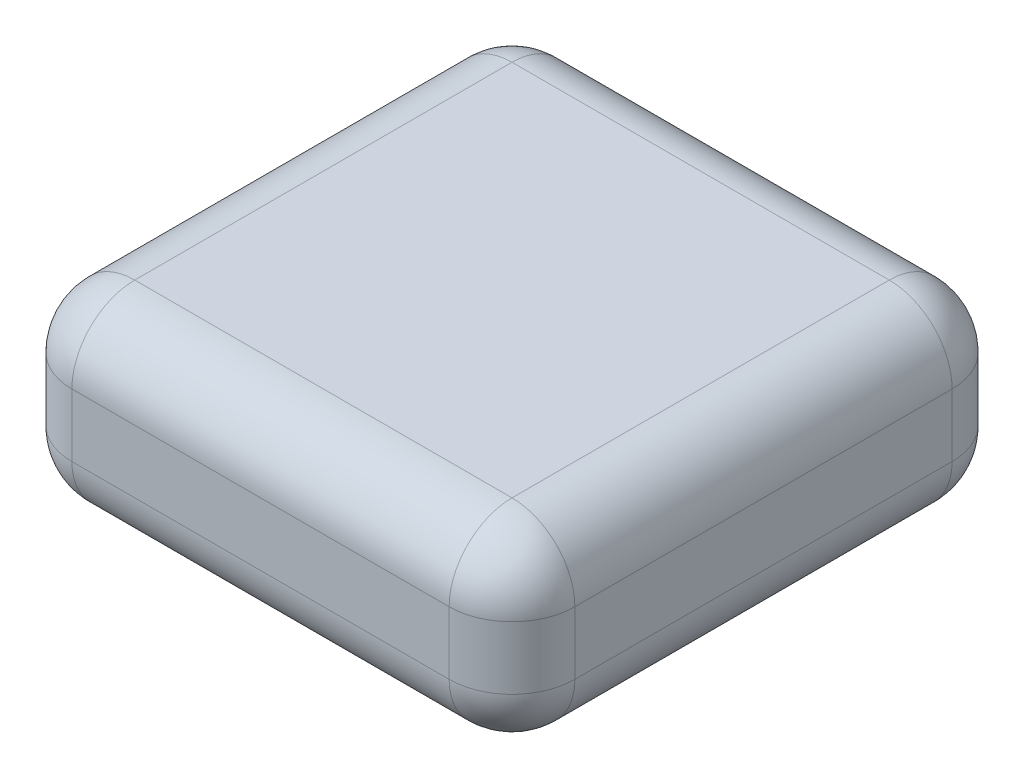
ISO-10303-21;
HEADER;
FILE_DESCRIPTION(('STEP AP214'),'2;1');
FILE_NAME('part.step','',(''),(''),'','','');
FILE_SCHEMA(('AUTOMOTIVE_DESIGN { 1 0 10303 214 1 1 1 1 }'));
ENDSEC;
DATA;
#1=APPLICATION_CONTEXT('core data for automotive mechanical design processes');
#2=APPLICATION_PROTOCOL_DEFINITION('international standard','automotive_design',2000,#1);
#3=PRODUCT_CONTEXT('',#1,'mechanical');
#4=PRODUCT('Part','Part','',(#3));
#5=PRODUCT_RELATED_PRODUCT_CATEGORY('part','',(#4));
#6=PRODUCT_DEFINITION_FORMATION('','',#4);
#7=PRODUCT_DEFINITION_CONTEXT('part definition',#1,'design');
#8=PRODUCT_DEFINITION('design','',#6,#7);
#9=PRODUCT_DEFINITION_SHAPE('','',#8);
#10=(LENGTH_UNIT() NAMED_UNIT(*) SI_UNIT(.MILLI.,.METRE.));
#11=(NAMED_UNIT(*) PLANE_ANGLE_UNIT() SI_UNIT($,.RADIAN.));
#12=(NAMED_UNIT(*) SI_UNIT($,.STERADIAN.) SOLID_ANGLE_UNIT());
#13=UNCERTAINTY_MEASURE_WITH_UNIT(LENGTH_MEASURE(1.E-05),#10,'distance_accuracy_value','');
#14=(GEOMETRIC_REPRESENTATION_CONTEXT(3) GLOBAL_UNCERTAINTY_ASSIGNED_CONTEXT((#13)) GLOBAL_UNIT_ASSIGNED_CONTEXT((#10,
#11,#12)) REPRESENTATION_CONTEXT('',''));
#15=CARTESIAN_POINT('',(0.,0.,0.));
#16=DIRECTION('',(0.,0.,1.));
#17=DIRECTION('',(1.,0.,0.));
#18=AXIS2_PLACEMENT_3D('',#15,#16,#17);
#19=CARTESIAN_POINT('',(609.6,457.2,-609.6));
#20=DIRECTION('',(-1.,0.,0.));
#21=DIRECTION('',(0.,0.,1.));
#22=AXIS2_PLACEMENT_3D('',#19,#20,#21);
#23=PLANE('',#22);
#24=DIRECTION('',(0.,0.,-1.));
#25=VECTOR('',#24,1.);
#26=CARTESIAN_POINT('',(609.6,152.4,-609.6));
#27=LINE('',#26,#25);
#28=CARTESIAN_POINT('',(609.6,152.4,457.2));
#29=VERTEX_POINT('',#28);
#30=CARTESIAN_POINT('',(609.6,152.4,-457.2));
#31=VERTEX_POINT('',#30);
#32=EDGE_CURVE('E172',#29,#31,#27,.T.);
#33=ORIENTED_EDGE('',*,*,#32,.T.);
#34=DIRECTION('',(0.,-1.,0.));
#35=VECTOR('',#34,1.);
#36=CARTESIAN_POINT('',(609.6,457.2,-457.2));
#37=LINE('',#36,#35);
#38=CARTESIAN_POINT('',(609.6,304.8,-457.2));
#39=VERTEX_POINT('',#38);
#40=EDGE_CURVE('E175',#31,#39,#37,.F.);
#41=ORIENTED_EDGE('',*,*,#40,.T.);
#42=DIRECTION('',(0.,0.,-1.));
#43=VECTOR('',#42,1.);
#44=CARTESIAN_POINT('',(609.6,304.8,609.6));
#45=LINE('',#44,#43);
#46=CARTESIAN_POINT('',(609.6,304.8,457.2));
#47=VERTEX_POINT('',#46);
#48=EDGE_CURVE('E170',#39,#47,#45,.F.);
#49=ORIENTED_EDGE('',*,*,#48,.T.);
#50=DIRECTION('',(0.,-1.,0.));
#51=VECTOR('',#50,1.);
#52=CARTESIAN_POINT('',(609.6,457.2,457.2));
#53=LINE('',#52,#51);
#54=EDGE_CURVE('E168',#47,#29,#53,.T.);
#55=ORIENTED_EDGE('',*,*,#54,.T.);
#56=EDGE_LOOP('',(#33,#41,#49,#55));
#57=FACE_BOUND('',#56,.T.);
#58=ADVANCED_FACE('F33',(#57),#23,.F.);
#59=CARTESIAN_POINT('',(-609.6,457.2,-609.6));
#60=DIRECTION('',(0.,0.,1.));
#61=DIRECTION('',(1.,0.,0.));
#62=AXIS2_PLACEMENT_3D('',#59,#60,#61);
#63=PLANE('',#62);
#64=DIRECTION('',(-1.,0.,0.));
#65=VECTOR('',#64,1.);
#66=CARTESIAN_POINT('',(609.6,304.8,-609.6));
#67=LINE('',#66,#65);
#68=CARTESIAN_POINT('',(-457.2,304.8,-609.6));
#69=VERTEX_POINT('',#68);
#70=CARTESIAN_POINT('',(457.2,304.8,-609.6));
#71=VERTEX_POINT('',#70);
#72=EDGE_CURVE('E190',#69,#71,#67,.F.);
#73=ORIENTED_EDGE('',*,*,#72,.T.);
#74=DIRECTION('',(0.,-1.,0.));
#75=VECTOR('',#74,1.);
#76=CARTESIAN_POINT('',(457.2,457.2,-609.6));
#77=LINE('',#76,#75);
#78=CARTESIAN_POINT('',(457.2,152.4,-609.6));
#79=VERTEX_POINT('',#78);
#80=EDGE_CURVE('E192',#71,#79,#77,.T.);
#81=ORIENTED_EDGE('',*,*,#80,.T.);
#82=DIRECTION('',(-1.,0.,0.));
#83=VECTOR('',#82,1.);
#84=CARTESIAN_POINT('',(-609.6,152.4,-609.6));
#85=LINE('',#84,#83);
#86=CARTESIAN_POINT('',(-457.2,152.4,-609.6));
#87=VERTEX_POINT('',#86);
#88=EDGE_CURVE('E186',#79,#87,#85,.T.);
#89=ORIENTED_EDGE('',*,*,#88,.T.);
#90=DIRECTION('',(0.,-1.,0.));
#91=VECTOR('',#90,1.);
#92=CARTESIAN_POINT('',(-457.2,457.2,-609.6));
#93=LINE('',#92,#91);
#94=EDGE_CURVE('E188',#87,#69,#93,.F.);
#95=ORIENTED_EDGE('',*,*,#94,.T.);
#96=EDGE_LOOP('',(#73,#81,#89,#95));
#97=FACE_BOUND('',#96,.T.);
#98=ADVANCED_FACE('F270',(#97),#63,.F.);
#99=CARTESIAN_POINT('',(-609.6,457.2,-609.6));
#100=DIRECTION('',(1.,0.,0.));
#101=DIRECTION('',(0.,0.,-1.));
#102=AXIS2_PLACEMENT_3D('',#99,#100,#101);
#103=PLANE('',#102);
#104=DIRECTION('',(0.,0.,1.));
#105=VECTOR('',#104,1.);
#106=CARTESIAN_POINT('',(-609.6,304.8,-609.6));
#107=LINE('',#106,#105);
#108=CARTESIAN_POINT('',(-609.6,304.8,457.2));
#109=VERTEX_POINT('',#108);
#110=CARTESIAN_POINT('',(-609.6,304.8,-457.2));
#111=VERTEX_POINT('',#110);
#112=EDGE_CURVE('E151',#109,#111,#107,.F.);
#113=ORIENTED_EDGE('',*,*,#112,.T.);
#114=DIRECTION('',(0.,-1.,0.));
#115=VECTOR('',#114,1.);
#116=CARTESIAN_POINT('',(-609.6,457.2,-457.2));
#117=LINE('',#116,#115);
#118=CARTESIAN_POINT('',(-609.6,152.4,-457.2));
#119=VERTEX_POINT('',#118);
#120=EDGE_CURVE('E155',#111,#119,#117,.T.);
#121=ORIENTED_EDGE('',*,*,#120,.T.);
#122=DIRECTION('',(0.,0.,1.));
#123=VECTOR('',#122,1.);
#124=CARTESIAN_POINT('',(-609.6,152.4,-609.6));
#125=LINE('',#124,#123);
#126=CARTESIAN_POINT('',(-609.6,152.4,457.2));
#127=VERTEX_POINT('',#126);
#128=EDGE_CURVE('E127',#119,#127,#125,.T.);
#129=ORIENTED_EDGE('',*,*,#128,.T.);
#130=DIRECTION('',(0.,-1.,0.));
#131=VECTOR('',#130,1.);
#132=CARTESIAN_POINT('',(-609.6,457.2,457.2));
#133=LINE('',#132,#131);
#134=EDGE_CURVE('E145',#127,#109,#133,.F.);
#135=ORIENTED_EDGE('',*,*,#134,.T.);
#136=EDGE_LOOP('',(#113,#121,#129,#135));
#137=FACE_BOUND('',#136,.T.);
#138=ADVANCED_FACE('F153',(#137),#103,.F.);
#139=CARTESIAN_POINT('',(-609.6,457.2,609.6));
#140=DIRECTION('',(0.,0.,-1.));
#141=DIRECTION('',(-1.,0.,0.));
#142=AXIS2_PLACEMENT_3D('',#139,#140,#141);
#143=PLANE('',#142);
#144=DIRECTION('',(1.,0.,0.));
#145=VECTOR('',#144,1.);
#146=CARTESIAN_POINT('',(-609.6,304.8,609.6));
#147=LINE('',#146,#145);
#148=CARTESIAN_POINT('',(457.2,304.8,609.6));
#149=VERTEX_POINT('',#148);
#150=CARTESIAN_POINT('',(-457.2,304.8,609.6));
#151=VERTEX_POINT('',#150);
#152=EDGE_CURVE('E42',#149,#151,#147,.F.);
#153=ORIENTED_EDGE('',*,*,#152,.T.);
#154=DIRECTION('',(0.,-1.,0.));
#155=VECTOR('',#154,1.);
#156=CARTESIAN_POINT('',(-457.2,457.2,609.6));
#157=LINE('',#156,#155);
#158=CARTESIAN_POINT('',(-457.2,152.4,609.6));
#159=VERTEX_POINT('',#158);
#160=EDGE_CURVE('E11',#151,#159,#157,.T.);
#161=ORIENTED_EDGE('',*,*,#160,.T.);
#162=DIRECTION('',(1.,0.,0.));
#163=VECTOR('',#162,1.);
#164=CARTESIAN_POINT('',(-609.6,152.4,609.6));
#165=LINE('',#164,#163);
#166=CARTESIAN_POINT('',(457.2,152.4,609.6));
#167=VERTEX_POINT('',#166);
#168=EDGE_CURVE('E195',#159,#167,#165,.T.);
#169=ORIENTED_EDGE('',*,*,#168,.T.);
#170=DIRECTION('',(0.,-1.,0.));
#171=VECTOR('',#170,1.);
#172=CARTESIAN_POINT('',(457.2,457.2,609.6));
#173=LINE('',#172,#171);
#174=EDGE_CURVE('E53',#167,#149,#173,.F.);
#175=ORIENTED_EDGE('',*,*,#174,.T.);
#176=EDGE_LOOP('',(#153,#161,#169,#175));
#177=FACE_BOUND('',#176,.T.);
#178=ADVANCED_FACE('F362',(#177),#143,.F.);
#179=CARTESIAN_POINT('',(0.,457.2,0.));
#180=DIRECTION('',(0.,1.,0.));
#181=DIRECTION('',(0.,0.,1.));
#182=AXIS2_PLACEMENT_3D('',#179,#180,#181);
#183=PLANE('',#182);
#184=DIRECTION('',(0.,0.,-1.));
#185=VECTOR('',#184,1.);
#186=CARTESIAN_POINT('',(457.2,457.2,-609.6));
#187=LINE('',#186,#185);
#188=CARTESIAN_POINT('',(457.2,457.2,457.2));
#189=VERTEX_POINT('',#188);
#190=CARTESIAN_POINT('',(457.2,457.2,-457.2));
#191=VERTEX_POINT('',#190);
#192=EDGE_CURVE('E179',#189,#191,#187,.T.);
#193=ORIENTED_EDGE('',*,*,#192,.T.);
#194=DIRECTION('',(-1.,0.,0.));
#195=VECTOR('',#194,1.);
#196=CARTESIAN_POINT('',(-609.6,457.2,-457.2));
#197=LINE('',#196,#195);
#198=CARTESIAN_POINT('',(-457.2,457.2,-457.2));
#199=VERTEX_POINT('',#198);
#200=EDGE_CURVE('E184',#191,#199,#197,.T.);
#201=ORIENTED_EDGE('',*,*,#200,.T.);
#202=DIRECTION('',(0.,0.,1.));
#203=VECTOR('',#202,1.);
#204=CARTESIAN_POINT('',(-457.2,457.2,609.6));
#205=LINE('',#204,#203);
#206=CARTESIAN_POINT('',(-457.2,457.2,457.2));
#207=VERTEX_POINT('',#206);
#208=EDGE_CURVE('E181',#199,#207,#205,.T.);
#209=ORIENTED_EDGE('',*,*,#208,.T.);
#210=DIRECTION('',(1.,0.,0.));
#211=VECTOR('',#210,1.);
#212=CARTESIAN_POINT('',(609.6,457.2,457.2));
#213=LINE('',#212,#211);
#214=EDGE_CURVE('E177',#207,#189,#213,.T.);
#215=ORIENTED_EDGE('',*,*,#214,.T.);
#216=EDGE_LOOP('',(#193,#201,#209,#215));
#217=FACE_BOUND('',#216,.T.);
#218=ADVANCED_FACE('F278',(#217),#183,.T.);
#219=CARTESIAN_POINT('',(0.,0.,0.));
#220=DIRECTION('',(0.,1.,0.));
#221=DIRECTION('',(0.,0.,1.));
#222=AXIS2_PLACEMENT_3D('',#219,#220,#221);
#223=PLANE('',#222);
#224=DIRECTION('',(0.,0.,1.));
#225=VECTOR('',#224,1.);
#226=CARTESIAN_POINT('',(-457.2,0.,0.));
#227=LINE('',#226,#225);
#228=CARTESIAN_POINT('',(-457.2,0.,457.2));
#229=VERTEX_POINT('',#228);
#230=CARTESIAN_POINT('',(-457.2,0.,-457.2));
#231=VERTEX_POINT('',#230);
#232=EDGE_CURVE('E129',#229,#231,#227,.F.);
#233=ORIENTED_EDGE('',*,*,#232,.T.);
#234=DIRECTION('',(-1.,0.,0.));
#235=VECTOR('',#234,1.);
#236=CARTESIAN_POINT('',(0.,0.,-457.2));
#237=LINE('',#236,#235);
#238=CARTESIAN_POINT('',(457.2,0.,-457.2));
#239=VERTEX_POINT('',#238);
#240=EDGE_CURVE('E166',#231,#239,#237,.F.);
#241=ORIENTED_EDGE('',*,*,#240,.T.);
#242=DIRECTION('',(0.,0.,-1.));
#243=VECTOR('',#242,1.);
#244=CARTESIAN_POINT('',(457.2,0.,0.));
#245=LINE('',#244,#243);
#246=CARTESIAN_POINT('',(457.2,0.,457.2));
#247=VERTEX_POINT('',#246);
#248=EDGE_CURVE('E163',#239,#247,#245,.F.);
#249=ORIENTED_EDGE('',*,*,#248,.T.);
#250=DIRECTION('',(1.,0.,0.));
#251=VECTOR('',#250,1.);
#252=CARTESIAN_POINT('',(0.,0.,457.2));
#253=LINE('',#252,#251);
#254=EDGE_CURVE('E158',#247,#229,#253,.F.);
#255=ORIENTED_EDGE('',*,*,#254,.T.);
#256=EDGE_LOOP('',(#233,#241,#249,#255));
#257=FACE_BOUND('',#256,.T.);
#258=ADVANCED_FACE('F355',(#257),#223,.F.);
#259=CARTESIAN_POINT('',(457.2,304.8,0.));
#260=DIRECTION('',(0.,0.,1.));
#261=DIRECTION('',(1.,0.,0.));
#262=AXIS2_PLACEMENT_3D('',#259,#260,#261);
#263=CYLINDRICAL_SURFACE('',#262,152.4);
#264=CARTESIAN_POINT('',(457.2,304.8,-457.2));
#265=DIRECTION('',(0.,0.,-1.));
#266=DIRECTION('',(-1.,0.,0.));
#267=AXIS2_PLACEMENT_3D('',#264,#265,#266);
#268=CIRCLE('',#267,152.4);
#269=EDGE_CURVE('E37',#191,#39,#268,.T.);
#270=ORIENTED_EDGE('',*,*,#269,.F.);
#271=ORIENTED_EDGE('',*,*,#192,.F.);
#272=CARTESIAN_POINT('',(457.2,304.8,457.2));
#273=DIRECTION('',(0.,0.,1.));
#274=DIRECTION('',(0.,-1.,0.));
#275=AXIS2_PLACEMENT_3D('',#272,#273,#274);
#276=CIRCLE('',#275,152.4);
#277=EDGE_CURVE('E248',#47,#189,#276,.T.);
#278=ORIENTED_EDGE('',*,*,#277,.F.);
#279=ORIENTED_EDGE('',*,*,#48,.F.);
#280=EDGE_LOOP('',(#270,#271,#278,#279));
#281=FACE_BOUND('',#280,.T.);
#282=ADVANCED_FACE('F35',(#281),#263,.T.);
#283=CARTESIAN_POINT('',(457.2,304.8,-457.2));
#284=DIRECTION('',(1.,0.,0.));
#285=DIRECTION('',(0.,0.,-1.));
#286=AXIS2_PLACEMENT_3D('',#283,#284,#285);
#287=SPHERICAL_SURFACE('',#286,152.4);
#288=CARTESIAN_POINT('',(457.2,304.8,-457.2));
#289=DIRECTION('',(1.,0.,0.));
#290=DIRECTION('',(0.,1.,0.));
#291=AXIS2_PLACEMENT_3D('',#288,#289,#290);
#292=CIRCLE('',#291,152.4);
#293=EDGE_CURVE('E243',#191,#71,#292,.F.);
#294=ORIENTED_EDGE('',*,*,#293,.F.);
#295=ORIENTED_EDGE('',*,*,#269,.T.);
#296=CARTESIAN_POINT('',(457.2,304.8,-457.2));
#297=DIRECTION('',(0.,1.,0.));
#298=DIRECTION('',(0.,0.,1.));
#299=AXIS2_PLACEMENT_3D('',#296,#297,#298);
#300=CIRCLE('',#299,152.4);
#301=EDGE_CURVE('E246',#71,#39,#300,.F.);
#302=ORIENTED_EDGE('',*,*,#301,.F.);
#303=EDGE_LOOP('',(#294,#295,#302));
#304=FACE_BOUND('',#303,.T.);
#305=ADVANCED_FACE('F259',(#304),#287,.T.);
#306=CARTESIAN_POINT('',(457.2,304.8,457.2));
#307=DIRECTION('',(0.,1.,0.));
#308=DIRECTION('',(0.,0.,1.));
#309=AXIS2_PLACEMENT_3D('',#306,#307,#308);
#310=SPHERICAL_SURFACE('',#309,152.4);
#311=CARTESIAN_POINT('',(457.2,304.8,457.2));
#312=DIRECTION('',(0.,1.,0.));
#313=DIRECTION('',(0.,0.,1.));
#314=AXIS2_PLACEMENT_3D('',#311,#312,#313);
#315=CIRCLE('',#314,152.4);
#316=EDGE_CURVE('E238',#47,#149,#315,.F.);
#317=ORIENTED_EDGE('',*,*,#316,.F.);
#318=ORIENTED_EDGE('',*,*,#277,.T.);
#319=CARTESIAN_POINT('',(457.2,304.8,457.2));
#320=DIRECTION('',(1.,0.,0.));
#321=DIRECTION('',(0.,0.,-1.));
#322=AXIS2_PLACEMENT_3D('',#319,#320,#321);
#323=CIRCLE('',#322,152.4);
#324=EDGE_CURVE('E240',#149,#189,#323,.F.);
#325=ORIENTED_EDGE('',*,*,#324,.F.);
#326=EDGE_LOOP('',(#317,#318,#325));
#327=FACE_BOUND('',#326,.T.);
#328=ADVANCED_FACE('F289',(#327),#310,.T.);
#329=CARTESIAN_POINT('',(457.2,457.2,-457.2));
#330=DIRECTION('',(0.,-1.,0.));
#331=DIRECTION('',(0.,0.,-1.));
#332=AXIS2_PLACEMENT_3D('',#329,#330,#331);
#333=CYLINDRICAL_SURFACE('',#332,152.4);
#334=ORIENTED_EDGE('',*,*,#301,.T.);
#335=ORIENTED_EDGE('',*,*,#40,.F.);
#336=CARTESIAN_POINT('',(457.2,152.4,-457.2));
#337=DIRECTION('',(0.,-1.,0.));
#338=DIRECTION('',(0.,0.,-1.));
#339=AXIS2_PLACEMENT_3D('',#336,#337,#338);
#340=CIRCLE('',#339,152.4);
#341=EDGE_CURVE('E233',#79,#31,#340,.T.);
#342=ORIENTED_EDGE('',*,*,#341,.F.);
#343=ORIENTED_EDGE('',*,*,#80,.F.);
#344=EDGE_LOOP('',(#334,#335,#342,#343));
#345=FACE_BOUND('',#344,.T.);
#346=ADVANCED_FACE('F267',(#345),#333,.T.);
#347=CARTESIAN_POINT('',(0.,304.8,-457.2));
#348=DIRECTION('',(1.,0.,0.));
#349=DIRECTION('',(0.,0.,-1.));
#350=AXIS2_PLACEMENT_3D('',#347,#348,#349);
#351=CYLINDRICAL_SURFACE('',#350,152.4);
#352=ORIENTED_EDGE('',*,*,#293,.T.);
#353=ORIENTED_EDGE('',*,*,#72,.F.);
#354=CARTESIAN_POINT('',(-457.2,304.8,-457.2));
#355=DIRECTION('',(-1.,0.,0.));
#356=DIRECTION('',(0.,0.,1.));
#357=AXIS2_PLACEMENT_3D('',#354,#355,#356);
#358=CIRCLE('',#357,152.4);
#359=EDGE_CURVE('E230',#199,#69,#358,.T.);
#360=ORIENTED_EDGE('',*,*,#359,.F.);
#361=ORIENTED_EDGE('',*,*,#200,.F.);
#362=EDGE_LOOP('',(#352,#353,#360,#361));
#363=FACE_BOUND('',#362,.T.);
#364=ADVANCED_FACE('F275',(#363),#351,.T.);
#365=CARTESIAN_POINT('',(-457.2,304.8,0.));
#366=DIRECTION('',(0.,0.,-1.));
#367=DIRECTION('',(-1.,0.,0.));
#368=AXIS2_PLACEMENT_3D('',#365,#366,#367);
#369=CYLINDRICAL_SURFACE('',#368,152.4);
#370=CARTESIAN_POINT('',(-457.2,304.8,457.2));
#371=DIRECTION('',(0.,0.,1.));
#372=DIRECTION('',(1.,0.,0.));
#373=AXIS2_PLACEMENT_3D('',#370,#371,#372);
#374=CIRCLE('',#373,152.4);
#375=EDGE_CURVE('E224',#207,#109,#374,.T.);
#376=ORIENTED_EDGE('',*,*,#375,.F.);
#377=ORIENTED_EDGE('',*,*,#208,.F.);
#378=CARTESIAN_POINT('',(-457.2,304.8,-457.2));
#379=DIRECTION('',(0.,0.,-1.));
#380=DIRECTION('',(-1.,0.,0.));
#381=AXIS2_PLACEMENT_3D('',#378,#379,#380);
#382=CIRCLE('',#381,152.4);
#383=EDGE_CURVE('E227',#111,#199,#382,.T.);
#384=ORIENTED_EDGE('',*,*,#383,.F.);
#385=ORIENTED_EDGE('',*,*,#112,.F.);
#386=EDGE_LOOP('',(#376,#377,#384,#385));
#387=FACE_BOUND('',#386,.T.);
#388=ADVANCED_FACE('F282',(#387),#369,.T.);
#389=CARTESIAN_POINT('',(0.,304.8,457.2));
#390=DIRECTION('',(-1.,0.,0.));
#391=DIRECTION('',(0.,0.,1.));
#392=AXIS2_PLACEMENT_3D('',#389,#390,#391);
#393=CYLINDRICAL_SURFACE('',#392,152.4);
#394=ORIENTED_EDGE('',*,*,#324,.T.);
#395=ORIENTED_EDGE('',*,*,#214,.F.);
#396=CARTESIAN_POINT('',(-457.2,304.8,457.2));
#397=DIRECTION('',(-1.,0.,0.));
#398=DIRECTION('',(0.,0.,1.));
#399=AXIS2_PLACEMENT_3D('',#396,#397,#398);
#400=CIRCLE('',#399,152.4);
#401=EDGE_CURVE('E222',#151,#207,#400,.T.);
#402=ORIENTED_EDGE('',*,*,#401,.F.);
#403=ORIENTED_EDGE('',*,*,#152,.F.);
#404=EDGE_LOOP('',(#394,#395,#402,#403));
#405=FACE_BOUND('',#404,.T.);
#406=ADVANCED_FACE('F287',(#405),#393,.T.);
#407=CARTESIAN_POINT('',(457.2,457.2,457.2));
#408=DIRECTION('',(0.,-1.,0.));
#409=DIRECTION('',(0.,0.,-1.));
#410=AXIS2_PLACEMENT_3D('',#407,#408,#409);
#411=CYLINDRICAL_SURFACE('',#410,152.4);
#412=ORIENTED_EDGE('',*,*,#316,.T.);
#413=ORIENTED_EDGE('',*,*,#174,.F.);
#414=CARTESIAN_POINT('',(457.2,152.4,457.2));
#415=DIRECTION('',(0.,-1.,0.));
#416=DIRECTION('',(0.,0.,-1.));
#417=AXIS2_PLACEMENT_3D('',#414,#415,#416);
#418=CIRCLE('',#417,152.4);
#419=EDGE_CURVE('E219',#29,#167,#418,.T.);
#420=ORIENTED_EDGE('',*,*,#419,.F.);
#421=ORIENTED_EDGE('',*,*,#54,.F.);
#422=EDGE_LOOP('',(#412,#413,#420,#421));
#423=FACE_BOUND('',#422,.T.);
#424=ADVANCED_FACE('F292',(#423),#411,.T.);
#425=CARTESIAN_POINT('',(457.2,152.4,-609.6));
#426=DIRECTION('',(0.,0.,-1.));
#427=DIRECTION('',(-1.,0.,0.));
#428=AXIS2_PLACEMENT_3D('',#425,#426,#427);
#429=CYLINDRICAL_SURFACE('',#428,152.4);
#430=CARTESIAN_POINT('',(457.2,152.4,-457.2));
#431=DIRECTION('',(0.,0.,-1.));
#432=DIRECTION('',(-1.,0.,0.));
#433=AXIS2_PLACEMENT_3D('',#430,#431,#432);
#434=CIRCLE('',#433,152.4);
#435=EDGE_CURVE('E235',#31,#239,#434,.T.);
#436=ORIENTED_EDGE('',*,*,#435,.F.);
#437=ORIENTED_EDGE('',*,*,#32,.F.);
#438=CARTESIAN_POINT('',(457.2,152.4,457.2));
#439=DIRECTION('',(0.,0.,1.));
#440=DIRECTION('',(1.,0.,0.));
#441=AXIS2_PLACEMENT_3D('',#438,#439,#440);
#442=CIRCLE('',#441,152.4);
#443=EDGE_CURVE('E216',#247,#29,#442,.T.);
#444=ORIENTED_EDGE('',*,*,#443,.F.);
#445=ORIENTED_EDGE('',*,*,#248,.F.);
#446=EDGE_LOOP('',(#436,#437,#444,#445));
#447=FACE_BOUND('',#446,.T.);
#448=ADVANCED_FACE('F298',(#447),#429,.T.);
#449=CARTESIAN_POINT('',(457.2,152.4,-457.2));
#450=DIRECTION('',(1.,0.,0.));
#451=DIRECTION('',(0.,0.,-1.));
#452=AXIS2_PLACEMENT_3D('',#449,#450,#451);
#453=SPHERICAL_SURFACE('',#452,152.4);
#454=ORIENTED_EDGE('',*,*,#341,.T.);
#455=ORIENTED_EDGE('',*,*,#435,.T.);
#456=CARTESIAN_POINT('',(457.2,152.4,-457.2));
#457=DIRECTION('',(1.,0.,0.));
#458=DIRECTION('',(0.,0.,-1.));
#459=AXIS2_PLACEMENT_3D('',#456,#457,#458);
#460=CIRCLE('',#459,152.4);
#461=EDGE_CURVE('E213',#79,#239,#460,.F.);
#462=ORIENTED_EDGE('',*,*,#461,.F.);
#463=EDGE_LOOP('',(#454,#455,#462));
#464=FACE_BOUND('',#463,.T.);
#465=ADVANCED_FACE('F303',(#464),#453,.T.);
#466=CARTESIAN_POINT('',(-457.2,304.8,-457.2));
#467=DIRECTION('',(0.,1.,0.));
#468=DIRECTION('',(0.,0.,1.));
#469=AXIS2_PLACEMENT_3D('',#466,#467,#468);
#470=SPHERICAL_SURFACE('',#469,152.4);
#471=ORIENTED_EDGE('',*,*,#383,.T.);
#472=ORIENTED_EDGE('',*,*,#359,.T.);
#473=CARTESIAN_POINT('',(-457.2,304.8,-457.2));
#474=DIRECTION('',(0.,1.,0.));
#475=DIRECTION('',(0.,0.,1.));
#476=AXIS2_PLACEMENT_3D('',#473,#474,#475);
#477=CIRCLE('',#476,152.4);
#478=EDGE_CURVE('E210',#111,#69,#477,.F.);
#479=ORIENTED_EDGE('',*,*,#478,.F.);
#480=EDGE_LOOP('',(#471,#472,#479));
#481=FACE_BOUND('',#480,.T.);
#482=ADVANCED_FACE('F314',(#481),#470,.T.);
#483=CARTESIAN_POINT('',(-457.2,304.8,457.2));
#484=DIRECTION('',(0.,1.,0.));
#485=DIRECTION('',(0.,0.,1.));
#486=AXIS2_PLACEMENT_3D('',#483,#484,#485);
#487=SPHERICAL_SURFACE('',#486,152.4);
#488=ORIENTED_EDGE('',*,*,#401,.T.);
#489=ORIENTED_EDGE('',*,*,#375,.T.);
#490=CARTESIAN_POINT('',(-457.2,304.8,457.2));
#491=DIRECTION('',(0.,1.,0.));
#492=DIRECTION('',(0.,0.,1.));
#493=AXIS2_PLACEMENT_3D('',#490,#491,#492);
#494=CIRCLE('',#493,152.4);
#495=EDGE_CURVE('E148',#151,#109,#494,.F.);
#496=ORIENTED_EDGE('',*,*,#495,.F.);
#497=EDGE_LOOP('',(#488,#489,#496));
#498=FACE_BOUND('',#497,.T.);
#499=ADVANCED_FACE('F316',(#498),#487,.T.);
#500=CARTESIAN_POINT('',(457.2,152.4,457.2));
#501=DIRECTION('',(1.,0.,0.));
#502=DIRECTION('',(0.,0.,-1.));
#503=AXIS2_PLACEMENT_3D('',#500,#501,#502);
#504=SPHERICAL_SURFACE('',#503,152.4);
#505=ORIENTED_EDGE('',*,*,#443,.T.);
#506=ORIENTED_EDGE('',*,*,#419,.T.);
#507=CARTESIAN_POINT('',(457.2,152.4,457.2));
#508=DIRECTION('',(1.,0.,0.));
#509=DIRECTION('',(0.,0.,-1.));
#510=AXIS2_PLACEMENT_3D('',#507,#508,#509);
#511=CIRCLE('',#510,152.4);
#512=EDGE_CURVE('E206',#247,#167,#511,.F.);
#513=ORIENTED_EDGE('',*,*,#512,.F.);
#514=EDGE_LOOP('',(#505,#506,#513));
#515=FACE_BOUND('',#514,.T.);
#516=ADVANCED_FACE('F322',(#515),#504,.T.);
#517=CARTESIAN_POINT('',(-609.6,152.4,-457.2));
#518=DIRECTION('',(-1.,0.,0.));
#519=DIRECTION('',(0.,0.,1.));
#520=AXIS2_PLACEMENT_3D('',#517,#518,#519);
#521=CYLINDRICAL_SURFACE('',#520,152.4);
#522=ORIENTED_EDGE('',*,*,#461,.T.);
#523=ORIENTED_EDGE('',*,*,#240,.F.);
#524=CARTESIAN_POINT('',(-457.2,152.4,-457.2));
#525=DIRECTION('',(-1.,0.,0.));
#526=DIRECTION('',(0.,0.,1.));
#527=AXIS2_PLACEMENT_3D('',#524,#525,#526);
#528=CIRCLE('',#527,152.4);
#529=EDGE_CURVE('E203',#87,#231,#528,.T.);
#530=ORIENTED_EDGE('',*,*,#529,.F.);
#531=ORIENTED_EDGE('',*,*,#88,.F.);
#532=EDGE_LOOP('',(#522,#523,#530,#531));
#533=FACE_BOUND('',#532,.T.);
#534=ADVANCED_FACE('F306',(#533),#521,.T.);
#535=CARTESIAN_POINT('',(-457.2,457.2,-457.2));
#536=DIRECTION('',(0.,-1.,0.));
#537=DIRECTION('',(0.,0.,-1.));
#538=AXIS2_PLACEMENT_3D('',#535,#536,#537);
#539=CYLINDRICAL_SURFACE('',#538,152.4);
#540=ORIENTED_EDGE('',*,*,#478,.T.);
#541=ORIENTED_EDGE('',*,*,#94,.F.);
#542=CARTESIAN_POINT('',(-457.2,152.4,-457.2));
#543=DIRECTION('',(0.,-1.,0.));
#544=DIRECTION('',(0.,0.,-1.));
#545=AXIS2_PLACEMENT_3D('',#542,#543,#544);
#546=CIRCLE('',#545,152.4);
#547=EDGE_CURVE('E142',#119,#87,#546,.T.);
#548=ORIENTED_EDGE('',*,*,#547,.F.);
#549=ORIENTED_EDGE('',*,*,#120,.F.);
#550=EDGE_LOOP('',(#540,#541,#548,#549));
#551=FACE_BOUND('',#550,.T.);
#552=ADVANCED_FACE('F312',(#551),#539,.T.);
#553=CARTESIAN_POINT('',(-457.2,457.2,457.2));
#554=DIRECTION('',(0.,-1.,0.));
#555=DIRECTION('',(0.,0.,-1.));
#556=AXIS2_PLACEMENT_3D('',#553,#554,#555);
#557=CYLINDRICAL_SURFACE('',#556,152.4);
#558=ORIENTED_EDGE('',*,*,#495,.T.);
#559=ORIENTED_EDGE('',*,*,#134,.F.);
#560=CARTESIAN_POINT('',(-457.2,152.4,457.2));
#561=DIRECTION('',(0.,-1.,0.));
#562=DIRECTION('',(0.,0.,-1.));
#563=AXIS2_PLACEMENT_3D('',#560,#561,#562);
#564=CIRCLE('',#563,152.4);
#565=EDGE_CURVE('E134',#159,#127,#564,.T.);
#566=ORIENTED_EDGE('',*,*,#565,.F.);
#567=ORIENTED_EDGE('',*,*,#160,.F.);
#568=EDGE_LOOP('',(#558,#559,#566,#567));
#569=FACE_BOUND('',#568,.T.);
#570=ADVANCED_FACE('F146',(#569),#557,.T.);
#571=CARTESIAN_POINT('',(-609.6,152.4,457.2));
#572=DIRECTION('',(1.,0.,0.));
#573=DIRECTION('',(0.,0.,-1.));
#574=AXIS2_PLACEMENT_3D('',#571,#572,#573);
#575=CYLINDRICAL_SURFACE('',#574,152.4);
#576=ORIENTED_EDGE('',*,*,#512,.T.);
#577=ORIENTED_EDGE('',*,*,#168,.F.);
#578=CARTESIAN_POINT('',(-457.2,152.4,457.2));
#579=DIRECTION('',(-1.,0.,0.));
#580=DIRECTION('',(0.,0.,1.));
#581=AXIS2_PLACEMENT_3D('',#578,#579,#580);
#582=CIRCLE('',#581,152.4);
#583=EDGE_CURVE('E138',#229,#159,#582,.T.);
#584=ORIENTED_EDGE('',*,*,#583,.F.);
#585=ORIENTED_EDGE('',*,*,#254,.F.);
#586=EDGE_LOOP('',(#576,#577,#584,#585));
#587=FACE_BOUND('',#586,.T.);
#588=ADVANCED_FACE('F339',(#587),#575,.T.);
#589=CARTESIAN_POINT('',(-457.2,152.4,-457.2));
#590=DIRECTION('',(0.,0.,-1.));
#591=DIRECTION('',(0.,1.,0.));
#592=AXIS2_PLACEMENT_3D('',#589,#590,#591);
#593=SPHERICAL_SURFACE('',#592,152.4);
#594=ORIENTED_EDGE('',*,*,#547,.T.);
#595=ORIENTED_EDGE('',*,*,#529,.T.);
#596=CARTESIAN_POINT('',(-457.2,152.4,-457.2));
#597=DIRECTION('',(0.,0.,-1.));
#598=DIRECTION('',(-1.,0.,0.));
#599=AXIS2_PLACEMENT_3D('',#596,#597,#598);
#600=CIRCLE('',#599,152.4);
#601=EDGE_CURVE('E131',#119,#231,#600,.F.);
#602=ORIENTED_EDGE('',*,*,#601,.F.);
#603=EDGE_LOOP('',(#594,#595,#602));
#604=FACE_BOUND('',#603,.T.);
#605=ADVANCED_FACE('F310',(#604),#593,.T.);
#606=CARTESIAN_POINT('',(-457.2,152.4,457.2));
#607=DIRECTION('',(0.,0.,1.));
#608=DIRECTION('',(0.,-1.,0.));
#609=AXIS2_PLACEMENT_3D('',#606,#607,#608);
#610=SPHERICAL_SURFACE('',#609,152.4);
#611=ORIENTED_EDGE('',*,*,#583,.T.);
#612=ORIENTED_EDGE('',*,*,#565,.T.);
#613=CARTESIAN_POINT('',(-457.2,152.4,457.2));
#614=DIRECTION('',(0.,0.,1.));
#615=DIRECTION('',(1.,0.,0.));
#616=AXIS2_PLACEMENT_3D('',#613,#614,#615);
#617=CIRCLE('',#616,152.4);
#618=EDGE_CURVE('E123',#229,#127,#617,.F.);
#619=ORIENTED_EDGE('',*,*,#618,.F.);
#620=EDGE_LOOP('',(#611,#612,#619));
#621=FACE_BOUND('',#620,.T.);
#622=ADVANCED_FACE('F136',(#621),#610,.T.);
#623=CARTESIAN_POINT('',(-457.2,152.4,-609.6));
#624=DIRECTION('',(0.,0.,1.));
#625=DIRECTION('',(1.,0.,0.));
#626=AXIS2_PLACEMENT_3D('',#623,#624,#625);
#627=CYLINDRICAL_SURFACE('',#626,152.4);
#628=ORIENTED_EDGE('',*,*,#601,.T.);
#629=ORIENTED_EDGE('',*,*,#232,.F.);
#630=ORIENTED_EDGE('',*,*,#618,.T.);
#631=ORIENTED_EDGE('',*,*,#128,.F.);
#632=EDGE_LOOP('',(#628,#629,#630,#631));
#633=FACE_BOUND('',#632,.T.);
#634=ADVANCED_FACE('F125',(#633),#627,.T.);
#635=CLOSED_SHELL('',(#58,#98,#138,#178,#218,#258,#282,#305,#328,#346,#364,#388,#406,#424,#448,
#465,#482,#499,#516,#534,#552,#570,#588,#605,#622,#634));
#636=MANIFOLD_SOLID_BREP('B2',#635);
#637=ADVANCED_BREP_SHAPE_REPRESENTATION('',(#18,#636),#14);
#638=SHAPE_DEFINITION_REPRESENTATION(#9,#637);
ENDSEC;
END-ISO-10303-21;
